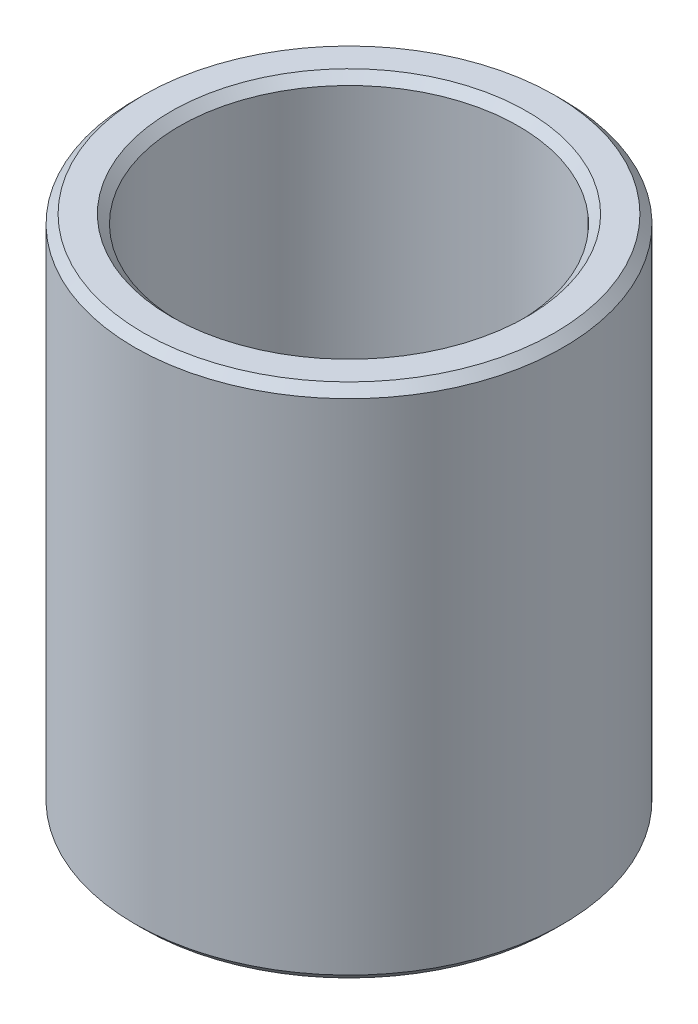
ISO-10303-21;
HEADER;
FILE_DESCRIPTION(('STEP AP214'),'2;1');
FILE_NAME('part.step','',(''),(''),'','','');
FILE_SCHEMA(('AUTOMOTIVE_DESIGN { 1 0 10303 214 1 1 1 1 }'));
ENDSEC;
DATA;
#1=APPLICATION_CONTEXT('core data for automotive mechanical design processes');
#2=APPLICATION_PROTOCOL_DEFINITION('international standard','automotive_design',2000,#1);
#3=PRODUCT_CONTEXT('',#1,'mechanical');
#4=PRODUCT('Part','Part','',(#3));
#5=PRODUCT_RELATED_PRODUCT_CATEGORY('part','',(#4));
#6=PRODUCT_DEFINITION_FORMATION('','',#4);
#7=PRODUCT_DEFINITION_CONTEXT('part definition',#1,'design');
#8=PRODUCT_DEFINITION('design','',#6,#7);
#9=PRODUCT_DEFINITION_SHAPE('','',#8);
#10=(LENGTH_UNIT() NAMED_UNIT(*) SI_UNIT(.MILLI.,.METRE.));
#11=(NAMED_UNIT(*) PLANE_ANGLE_UNIT() SI_UNIT($,.RADIAN.));
#12=(NAMED_UNIT(*) SI_UNIT($,.STERADIAN.) SOLID_ANGLE_UNIT());
#13=UNCERTAINTY_MEASURE_WITH_UNIT(LENGTH_MEASURE(1.E-05),#10,'distance_accuracy_value','');
#14=(GEOMETRIC_REPRESENTATION_CONTEXT(3) GLOBAL_UNCERTAINTY_ASSIGNED_CONTEXT((#13)) GLOBAL_UNIT_ASSIGNED_CONTEXT((#10,
#11,#12)) REPRESENTATION_CONTEXT('',''));
#15=CARTESIAN_POINT('',(0.,0.,0.));
#16=DIRECTION('',(0.,0.,1.));
#17=DIRECTION('',(1.,0.,0.));
#18=AXIS2_PLACEMENT_3D('',#15,#16,#17);
#19=CARTESIAN_POINT('',(0.,84.3259776392173,0.));
#20=DIRECTION('',(0.,-1.,0.));
#21=DIRECTION('',(0.,0.,-1.));
#22=AXIS2_PLACEMENT_3D('',#19,#20,#21);
#23=CYLINDRICAL_SURFACE('',#22,35.);
#24=CARTESIAN_POINT('',(0.,1.39012935939409,0.));
#25=DIRECTION('',(0.,1.,0.));
#26=DIRECTION('',(0.,0.,1.));
#27=AXIS2_PLACEMENT_3D('',#24,#25,#26);
#28=CIRCLE('',#27,35.);
#29=CARTESIAN_POINT('',(0.,1.39012935939409,35.));
#30=VERTEX_POINT('',#29);
#31=EDGE_CURVE('E10',#30,#30,#28,.T.);
#32=ORIENTED_EDGE('',*,*,#31,.T.);
#33=EDGE_LOOP('',(#32));
#34=FACE_BOUND('',#33,.T.);
#35=CARTESIAN_POINT('',(0.,82.9358482798232,0.));
#36=DIRECTION('',(0.,1.,0.));
#37=DIRECTION('',(0.,0.,1.));
#38=AXIS2_PLACEMENT_3D('',#35,#36,#37);
#39=CIRCLE('',#38,35.);
#40=CARTESIAN_POINT('',(0.,82.9358482798232,-35.));
#41=VERTEX_POINT('',#40);
#42=EDGE_CURVE('E50',#41,#41,#39,.F.);
#43=ORIENTED_EDGE('',*,*,#42,.T.);
#44=EDGE_LOOP('',(#43));
#45=FACE_BOUND('',#44,.T.);
#46=ADVANCED_FACE('F39',(#34,#45),#23,.T.);
#47=CARTESIAN_POINT('',(0.,84.3259776392173,0.));
#48=DIRECTION('',(0.,1.,0.));
#49=DIRECTION('',(0.,0.,1.));
#50=AXIS2_PLACEMENT_3D('',#47,#48,#49);
#51=PLANE('',#50);
#52=CARTESIAN_POINT('',(0.,84.3259776392173,0.));
#53=DIRECTION('',(0.,1.,0.));
#54=DIRECTION('',(0.,0.,1.));
#55=AXIS2_PLACEMENT_3D('',#52,#53,#54);
#56=CIRCLE('',#55,29.0660330695742);
#57=CARTESIAN_POINT('',(0.,84.3259776392173,29.0660330695742));
#58=VERTEX_POINT('',#57);
#59=EDGE_CURVE('E58',#58,#58,#56,.F.);
#60=ORIENTED_EDGE('',*,*,#59,.T.);
#61=EDGE_LOOP('',(#60));
#62=FACE_BOUND('',#61,.T.);
#63=CARTESIAN_POINT('',(0.,84.3259776392173,0.));
#64=DIRECTION('',(0.,1.,0.));
#65=DIRECTION('',(0.,0.,1.));
#66=AXIS2_PLACEMENT_3D('',#63,#64,#65);
#67=CIRCLE('',#66,33.6098706406059);
#68=CARTESIAN_POINT('',(0.,84.3259776392173,-33.6098706406059));
#69=VERTEX_POINT('',#68);
#70=EDGE_CURVE('E61',#69,#69,#67,.T.);
#71=ORIENTED_EDGE('',*,*,#70,.T.);
#72=EDGE_LOOP('',(#71));
#73=FACE_BOUND('',#72,.T.);
#74=ADVANCED_FACE('F88',(#62,#73),#51,.T.);
#75=CARTESIAN_POINT('',(0.,0.,0.));
#76=DIRECTION('',(0.,1.,0.));
#77=DIRECTION('',(0.,0.,1.));
#78=AXIS2_PLACEMENT_3D('',#75,#76,#77);
#79=PLANE('',#78);
#80=CARTESIAN_POINT('',(0.,0.,0.));
#81=DIRECTION('',(0.,1.,0.));
#82=DIRECTION('',(0.,0.,1.));
#83=AXIS2_PLACEMENT_3D('',#80,#81,#82);
#84=CIRCLE('',#83,29.0660330695742);
#85=CARTESIAN_POINT('',(0.,0.,29.0660330695742));
#86=VERTEX_POINT('',#85);
#87=EDGE_CURVE('E51',#86,#86,#84,.T.);
#88=ORIENTED_EDGE('',*,*,#87,.T.);
#89=EDGE_LOOP('',(#88));
#90=FACE_BOUND('',#89,.T.);
#91=CARTESIAN_POINT('',(0.,0.,0.));
#92=DIRECTION('',(0.,1.,0.));
#93=DIRECTION('',(0.,0.,1.));
#94=AXIS2_PLACEMENT_3D('',#91,#92,#93);
#95=CIRCLE('',#94,33.6098706406059);
#96=CARTESIAN_POINT('',(0.,0.,33.6098706406059));
#97=VERTEX_POINT('',#96);
#98=EDGE_CURVE('E54',#97,#97,#95,.F.);
#99=ORIENTED_EDGE('',*,*,#98,.T.);
#100=EDGE_LOOP('',(#99));
#101=FACE_BOUND('',#100,.T.);
#102=ADVANCED_FACE('F83',(#90,#101),#79,.F.);
#103=CARTESIAN_POINT('',(0.,84.3259776392173,0.));
#104=DIRECTION('',(0.,-1.,0.));
#105=DIRECTION('',(0.,0.,-1.));
#106=AXIS2_PLACEMENT_3D('',#103,#104,#105);
#107=CYLINDRICAL_SURFACE('',#106,27.6759037101801);
#108=CARTESIAN_POINT('',(0.,82.9358482798232,0.));
#109=DIRECTION('',(0.,1.,0.));
#110=DIRECTION('',(0.,0.,1.));
#111=AXIS2_PLACEMENT_3D('',#108,#109,#110);
#112=CIRCLE('',#111,27.6759037101801);
#113=CARTESIAN_POINT('',(0.,82.9358482798232,27.6759037101801));
#114=VERTEX_POINT('',#113);
#115=EDGE_CURVE('E67',#114,#114,#112,.T.);
#116=ORIENTED_EDGE('',*,*,#115,.T.);
#117=EDGE_LOOP('',(#116));
#118=FACE_BOUND('',#117,.T.);
#119=CARTESIAN_POINT('',(0.,1.39012935939409,0.));
#120=DIRECTION('',(0.,1.,0.));
#121=DIRECTION('',(0.,0.,1.));
#122=AXIS2_PLACEMENT_3D('',#119,#120,#121);
#123=CIRCLE('',#122,27.6759037101801);
#124=CARTESIAN_POINT('',(0.,1.39012935939409,27.6759037101801));
#125=VERTEX_POINT('',#124);
#126=EDGE_CURVE('E69',#125,#125,#123,.F.);
#127=ORIENTED_EDGE('',*,*,#126,.T.);
#128=EDGE_LOOP('',(#127));
#129=FACE_BOUND('',#128,.T.);
#130=ADVANCED_FACE('F71',(#118,#129),#107,.F.);
#131=CARTESIAN_POINT('',(0.,82.9358482798232,0.));
#132=DIRECTION('',(0.,1.,0.));
#133=DIRECTION('',(0.,0.,1.));
#134=AXIS2_PLACEMENT_3D('',#131,#132,#133);
#135=CONICAL_SURFACE('',#134,27.6759037101801,0.78539816339745);
#136=ORIENTED_EDGE('',*,*,#59,.F.);
#137=EDGE_LOOP('',(#136));
#138=FACE_BOUND('',#137,.T.);
#139=ORIENTED_EDGE('',*,*,#115,.F.);
#140=EDGE_LOOP('',(#139));
#141=FACE_BOUND('',#140,.T.);
#142=ADVANCED_FACE('F77',(#138,#141),#135,.F.);
#143=CARTESIAN_POINT('',(0.,0.,0.));
#144=DIRECTION('',(0.,-1.,0.));
#145=DIRECTION('',(0.,0.,-1.));
#146=AXIS2_PLACEMENT_3D('',#143,#144,#145);
#147=CONICAL_SURFACE('',#146,29.0660330695742,0.785398163397445);
#148=ORIENTED_EDGE('',*,*,#126,.F.);
#149=EDGE_LOOP('',(#148));
#150=FACE_BOUND('',#149,.T.);
#151=ORIENTED_EDGE('',*,*,#87,.F.);
#152=EDGE_LOOP('',(#151));
#153=FACE_BOUND('',#152,.T.);
#154=ADVANCED_FACE('F73',(#150,#153),#147,.F.);
#155=CARTESIAN_POINT('',(0.,1.39012935939409,0.));
#156=DIRECTION('',(0.,1.,0.));
#157=DIRECTION('',(0.,0.,1.));
#158=AXIS2_PLACEMENT_3D('',#155,#156,#157);
#159=CONICAL_SURFACE('',#158,35.,0.785398163397453);
#160=ORIENTED_EDGE('',*,*,#98,.F.);
#161=EDGE_LOOP('',(#160));
#162=FACE_BOUND('',#161,.T.);
#163=ORIENTED_EDGE('',*,*,#31,.F.);
#164=EDGE_LOOP('',(#163));
#165=FACE_BOUND('',#164,.T.);
#166=ADVANCED_FACE('F76',(#162,#165),#159,.T.);
#167=CARTESIAN_POINT('',(0.,84.3259776392173,0.));
#168=DIRECTION('',(0.,-1.,0.));
#169=DIRECTION('',(0.,0.,-1.));
#170=AXIS2_PLACEMENT_3D('',#167,#168,#169);
#171=CONICAL_SURFACE('',#170,33.6098706406059,0.785398163397446);
#172=CARTESIAN_POINT('',(0.,82.9358482798232,-35.));
#173=CARTESIAN_POINT('',(0.,82.9503287939835,-34.9855194858397));
#174=CARTESIAN_POINT('',(0.,82.9648093081439,-34.9710389716793));
#175=CARTESIAN_POINT('',(0.,82.9937703364646,-34.9420779433586));
#176=CARTESIAN_POINT('',(0.,83.0082508506249,-34.9275974291982));
#177=CARTESIAN_POINT('',(0.,83.0372118789456,-34.8986364008775));
#178=CARTESIAN_POINT('',(0.,83.051692393106,-34.8841558867172));
#179=CARTESIAN_POINT('',(0.,83.0806534214267,-34.8551948583965));
#180=CARTESIAN_POINT('',(0.,83.0951339355871,-34.8407143442361));
#181=CARTESIAN_POINT('',(0.,83.1240949639078,-34.8117533159154));
#182=CARTESIAN_POINT('',(0.,83.1385754780681,-34.797272801755));
#183=CARTESIAN_POINT('',(0.,83.1675365063888,-34.7683117734343));
#184=CARTESIAN_POINT('',(0.,83.1820170205492,-34.753831259274));
#185=CARTESIAN_POINT('',(0.,83.2109780488699,-34.7248702309533));
#186=CARTESIAN_POINT('',(0.,83.2254585630303,-34.7103897167929));
#187=CARTESIAN_POINT('',(0.,83.254419591351,-34.6814286884722));
#188=CARTESIAN_POINT('',(0.,83.2689001055113,-34.6669481743119));
#189=CARTESIAN_POINT('',(0.,83.297861133832,-34.6379871459911));
#190=CARTESIAN_POINT('',(0.,83.3123416479924,-34.6235066318308));
#191=CARTESIAN_POINT('',(0.,83.3413026763131,-34.5945456035101));
#192=CARTESIAN_POINT('',(0.,83.3557831904735,-34.5800650893497));
#193=CARTESIAN_POINT('',(0.,83.3847442187942,-34.551104061029));
#194=CARTESIAN_POINT('',(0.,83.3992247329545,-34.5366235468687));
#195=CARTESIAN_POINT('',(0.,83.4281857612752,-34.5076625185479));
#196=CARTESIAN_POINT('',(0.,83.4426662754356,-34.4931820043876));
#197=CARTESIAN_POINT('',(0.,83.4716273037563,-34.4642209760669));
#198=CARTESIAN_POINT('',(0.,83.4861078179167,-34.4497404619065));
#199=CARTESIAN_POINT('',(0.,83.5150688462374,-34.4207794335858));
#200=CARTESIAN_POINT('',(0.,83.5295493603977,-34.4062989194255));
#201=CARTESIAN_POINT('',(0.,83.5585103887184,-34.3773378911047));
#202=CARTESIAN_POINT('',(0.,83.5729909028788,-34.3628573769444));
#203=CARTESIAN_POINT('',(0.,83.6019519311995,-34.3338963486237));
#204=CARTESIAN_POINT('',(0.,83.6164324453598,-34.3194158344633));
#205=CARTESIAN_POINT('',(0.,83.6453934736806,-34.2904548061426));
#206=CARTESIAN_POINT('',(0.,83.6598739878409,-34.2759742919823));
#207=CARTESIAN_POINT('',(0.,83.6888350161616,-34.2470132636615));
#208=CARTESIAN_POINT('',(0.,83.703315530322,-34.2325327495012));
#209=CARTESIAN_POINT('',(0.,83.7322765586427,-34.2035717211805));
#210=CARTESIAN_POINT('',(0.,83.746757072803,-34.1890912070201));
#211=CARTESIAN_POINT('',(0.,83.7757181011237,-34.1601301786994));
#212=CARTESIAN_POINT('',(0.,83.7901986152841,-34.1456496645391));
#213=CARTESIAN_POINT('',(0.,83.8191596436048,-34.1166886362183));
#214=CARTESIAN_POINT('',(0.,83.8336401577652,-34.102208122058));
#215=CARTESIAN_POINT('',(0.,83.8626011860859,-34.0732470937373));
#216=CARTESIAN_POINT('',(0.,83.8770817002462,-34.0587665795769));
#217=CARTESIAN_POINT('',(0.,83.9060427285669,-34.0298055512562));
#218=CARTESIAN_POINT('',(0.,83.9205232427273,-34.0153250370959));
#219=CARTESIAN_POINT('',(0.,83.949484271048,-33.9863640087752));
#220=CARTESIAN_POINT('',(0.,83.9639647852084,-33.9718834946148));
#221=CARTESIAN_POINT('',(0.,83.9929258135291,-33.9429224662941));
#222=CARTESIAN_POINT('',(0.,84.0074063276894,-33.9284419521337));
#223=CARTESIAN_POINT('',(0.,84.0363673560101,-33.899480923813));
#224=CARTESIAN_POINT('',(0.,84.0508478701705,-33.8850004096527));
#225=CARTESIAN_POINT('',(0.,84.0798088984912,-33.856039381332));
#226=CARTESIAN_POINT('',(0.,84.0942894126516,-33.8415588671716));
#227=CARTESIAN_POINT('',(0.,84.1232504409723,-33.8125978388509));
#228=CARTESIAN_POINT('',(0.,84.1377309551326,-33.7981173246905));
#229=CARTESIAN_POINT('',(0.,84.1666919834533,-33.7691562963698));
#230=CARTESIAN_POINT('',(0.,84.1811724976137,-33.7546757822095));
#231=CARTESIAN_POINT('',(0.,84.2101335259344,-33.7257147538888));
#232=CARTESIAN_POINT('',(0.,84.2246140400948,-33.7112342397284));
#233=CARTESIAN_POINT('',(0.,84.2535750684155,-33.6822732114077));
#234=CARTESIAN_POINT('',(0.,84.2680555825758,-33.6677926972473));
#235=CARTESIAN_POINT('',(0.,84.2970166108965,-33.6388316689266));
#236=CARTESIAN_POINT('',(0.,84.3114971250569,-33.6243511547663));
#237=CARTESIAN_POINT('',(0.,84.3259776392173,-33.6098706406059));
#238=B_SPLINE_CURVE_WITH_KNOTS('',3,(#172,#173,#174,#175,#176,#177,#178,#179,#180,#181,#182,
#183,#184,#185,#186,#187,#188,#189,#190,#191,#192,#193,#194,#195,#196,#197,#198,#199,#200,#201,
#202,#203,#204,#205,#206,#207,#208,#209,#210,#211,#212,#213,#214,#215,#216,#217,#218,#219,#220,
#221,#222,#223,#224,#225,#226,#227,#228,#229,#230,#231,#232,#233,#234,#235,#236,#237),
.UNSPECIFIED.,.F.,.F.,(4,2,2,2,2,2,2,2,2,2,2,2,2,2,2,2,2,2,2,2,2,2,2,2,2,2,2,2,2,2,2,2,4),(0.,
0.0614356185471294,0.122871237094259,0.184306855641388,0.245742474188518,0.307178092735647,
0.368613711282776,0.430049329829906,0.491484948377035,0.552920566924165,0.614356185471294,
0.675791804018424,0.737227422565553,0.798663041112682,0.860098659659812,0.921534278206941,
0.982969896754071,1.04440551530121,1.10584113384833,1.16727675239546,1.22871237094259,
1.29014798948972,1.35158360803685,1.41301922658398,1.47445484513111,1.53589046367824,
1.59732608222537,1.6587617007725,1.72019731931963,1.78163293786676,1.84306855641389,
1.90450417496102,1.96593979350816),.UNSPECIFIED.);
#239=EDGE_CURVE('BSEAM45',#41,#69,#238,.T.);
#240=ORIENTED_EDGE('',*,*,#42,.F.);
#241=ORIENTED_EDGE('',*,*,#70,.F.);
#242=ORIENTED_EDGE('',*,*,#239,.T.);
#243=ORIENTED_EDGE('',*,*,#239,.F.);
#244=EDGE_LOOP('',(#240,#242,#241,#243));
#245=FACE_BOUND('',#244,.T.);
#246=ADVANCED_FACE('F45',(#245),#171,.T.);
#247=CLOSED_SHELL('',(#46,#74,#102,#130,#142,#154,#166,#246));
#248=MANIFOLD_SOLID_BREP('B2',#247);
#249=ADVANCED_BREP_SHAPE_REPRESENTATION('',(#18,#248),#14);
#250=SHAPE_DEFINITION_REPRESENTATION(#9,#249);
ENDSEC;
END-ISO-10303-21;
